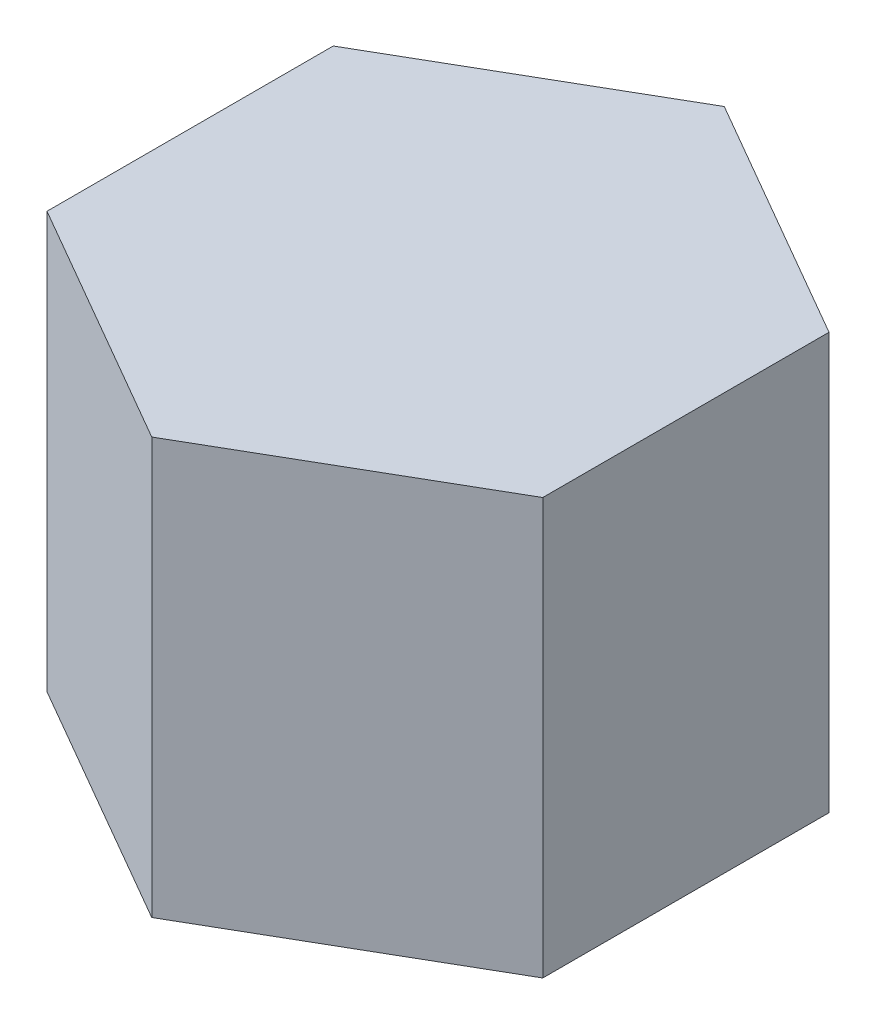
ISO-10303-21;
HEADER;
FILE_DESCRIPTION(('STEP AP214'),'2;1');
FILE_NAME('part.step','',(''),(''),'','','');
FILE_SCHEMA(('AUTOMOTIVE_DESIGN { 1 0 10303 214 1 1 1 1 }'));
ENDSEC;
DATA;
#1=APPLICATION_CONTEXT('core data for automotive mechanical design processes');
#2=APPLICATION_PROTOCOL_DEFINITION('international standard','automotive_design',2000,#1);
#3=PRODUCT_CONTEXT('',#1,'mechanical');
#4=PRODUCT('Part','Part','',(#3));
#5=PRODUCT_RELATED_PRODUCT_CATEGORY('part','',(#4));
#6=PRODUCT_DEFINITION_FORMATION('','',#4);
#7=PRODUCT_DEFINITION_CONTEXT('part definition',#1,'design');
#8=PRODUCT_DEFINITION('design','',#6,#7);
#9=PRODUCT_DEFINITION_SHAPE('','',#8);
#10=(LENGTH_UNIT() NAMED_UNIT(*) SI_UNIT(.MILLI.,.METRE.));
#11=(NAMED_UNIT(*) PLANE_ANGLE_UNIT() SI_UNIT($,.RADIAN.));
#12=(NAMED_UNIT(*) SI_UNIT($,.STERADIAN.) SOLID_ANGLE_UNIT());
#13=UNCERTAINTY_MEASURE_WITH_UNIT(LENGTH_MEASURE(1.E-05),#10,'distance_accuracy_value','');
#14=(GEOMETRIC_REPRESENTATION_CONTEXT(3) GLOBAL_UNCERTAINTY_ASSIGNED_CONTEXT((#13)) GLOBAL_UNIT_ASSIGNED_CONTEXT((#10,
#11,#12)) REPRESENTATION_CONTEXT('',''));
#15=CARTESIAN_POINT('',(0.,0.,0.));
#16=DIRECTION('',(0.,0.,1.));
#17=DIRECTION('',(1.,0.,0.));
#18=AXIS2_PLACEMENT_3D('',#15,#16,#17);
#19=CARTESIAN_POINT('',(207.339551417382,-147.556598747966,289.949920412926));
#20=DIRECTION('',(-0.499999999999943,0.,-0.866025403784471));
#21=DIRECTION('',(-0.866025403784471,0.,0.499999999999943));
#22=AXIS2_PLACEMENT_3D('',#19,#20,#21);
#23=PLANE('',#22);
#24=CARTESIAN_POINT('',(207.642660308706,-147.047793579175,289.774920412926));
#25=DIRECTION('',(-0.866025403784471,0.,0.499999999999943));
#26=VECTOR('',#25,1.);
#27=LINE('',#24,#26);
#28=CARTESIAN_POINT('',(207.642660308706,-147.047793579175,289.774920412926));
#29=VERTEX_POINT('',#28);
#30=CARTESIAN_POINT('',(207.339551417382,-147.047793579175,289.949920412926));
#31=VERTEX_POINT('',#30);
#32=EDGE_CURVE('E170',#29,#31,#27,.T.);
#33=ORIENTED_EDGE('',*,*,#32,.T.);
#34=CARTESIAN_POINT('',(207.339551417382,-147.556598747966,289.949920412926));
#35=DIRECTION('',(0.,1.,0.));
#36=VECTOR('',#35,1.);
#37=LINE('',#34,#36);
#38=CARTESIAN_POINT('',(207.339551417382,-147.556598747966,289.949920412926));
#39=VERTEX_POINT('',#38);
#40=EDGE_CURVE('E35',#39,#31,#37,.T.);
#41=ORIENTED_EDGE('',*,*,#40,.F.);
#42=CARTESIAN_POINT('',(207.642660308706,-147.556598747966,289.774920412926));
#43=DIRECTION('',(-0.866025403784471,0.,0.499999999999943));
#44=VECTOR('',#43,1.);
#45=LINE('',#42,#44);
#46=CARTESIAN_POINT('',(207.642660308706,-147.556598747966,289.774920412926));
#47=VERTEX_POINT('',#46);
#48=EDGE_CURVE('E159',#47,#39,#45,.T.);
#49=ORIENTED_EDGE('',*,*,#48,.F.);
#50=CARTESIAN_POINT('',(207.642660308706,-147.556598747966,289.774920412926));
#51=DIRECTION('',(0.,1.,0.));
#52=VECTOR('',#51,1.);
#53=LINE('',#50,#52);
#54=EDGE_CURVE('E10',#47,#29,#53,.T.);
#55=ORIENTED_EDGE('',*,*,#54,.T.);
#56=EDGE_LOOP('',(#33,#41,#49,#55));
#57=FACE_BOUND('',#56,.T.);
#58=ADVANCED_FACE('F16',(#57),#23,.F.);
#59=CARTESIAN_POINT('',(207.642660308706,-147.556598747966,291.594471220494));
#60=DIRECTION('',(-1.,0.,0.));
#61=DIRECTION('',(0.,-1.,0.));
#62=AXIS2_PLACEMENT_3D('',#59,#60,#61);
#63=PLANE('',#62);
#64=CARTESIAN_POINT('',(207.642660308706,-147.047793579175,289.424920412926));
#65=DIRECTION('',(0.,0.,1.));
#66=VECTOR('',#65,1.);
#67=LINE('',#64,#66);
#68=CARTESIAN_POINT('',(207.642660308706,-147.047793579175,289.424920412926));
#69=VERTEX_POINT('',#68);
#70=EDGE_CURVE('E167',#69,#29,#67,.T.);
#71=ORIENTED_EDGE('',*,*,#70,.T.);
#72=ORIENTED_EDGE('',*,*,#54,.F.);
#73=CARTESIAN_POINT('',(207.642660308706,-147.556598747966,289.424920412926));
#74=DIRECTION('',(0.,0.,1.));
#75=VECTOR('',#74,1.);
#76=LINE('',#73,#75);
#77=CARTESIAN_POINT('',(207.642660308706,-147.556598747966,289.424920412926));
#78=VERTEX_POINT('',#77);
#79=EDGE_CURVE('E156',#78,#47,#76,.T.);
#80=ORIENTED_EDGE('',*,*,#79,.F.);
#81=CARTESIAN_POINT('',(207.642660308706,-147.556598747966,289.424920412926));
#82=DIRECTION('',(0.,1.,0.));
#83=VECTOR('',#82,1.);
#84=LINE('',#81,#83);
#85=EDGE_CURVE('E27',#78,#69,#84,.T.);
#86=ORIENTED_EDGE('',*,*,#85,.T.);
#87=EDGE_LOOP('',(#71,#72,#80,#86));
#88=FACE_BOUND('',#87,.T.);
#89=ADVANCED_FACE('F189',(#88),#63,.F.);
#90=CARTESIAN_POINT('',(207.642660308706,-147.556598747966,289.424920412926));
#91=DIRECTION('',(-0.499999999999943,0.,0.866025403784471));
#92=DIRECTION('',(0.866025403784471,0.,0.499999999999943));
#93=AXIS2_PLACEMENT_3D('',#90,#91,#92);
#94=PLANE('',#93);
#95=CARTESIAN_POINT('',(207.339551417382,-147.047793579175,289.249920412926));
#96=DIRECTION('',(0.866025403784471,0.,0.499999999999943));
#97=VECTOR('',#96,1.);
#98=LINE('',#95,#97);
#99=CARTESIAN_POINT('',(207.339551417382,-147.047793579175,289.249920412926));
#100=VERTEX_POINT('',#99);
#101=EDGE_CURVE('E163',#100,#69,#98,.T.);
#102=ORIENTED_EDGE('',*,*,#101,.T.);
#103=ORIENTED_EDGE('',*,*,#85,.F.);
#104=CARTESIAN_POINT('',(207.339551417382,-147.556598747966,289.249920412926));
#105=DIRECTION('',(0.866025403784471,0.,0.499999999999943));
#106=VECTOR('',#105,1.);
#107=LINE('',#104,#106);
#108=CARTESIAN_POINT('',(207.339551417382,-147.556598747966,289.249920412926));
#109=VERTEX_POINT('',#108);
#110=EDGE_CURVE('E106',#109,#78,#107,.T.);
#111=ORIENTED_EDGE('',*,*,#110,.F.);
#112=CARTESIAN_POINT('',(207.339551417382,-147.556598747966,289.249920412926));
#113=DIRECTION('',(0.,1.,0.));
#114=VECTOR('',#113,1.);
#115=LINE('',#112,#114);
#116=EDGE_CURVE('E94',#109,#100,#115,.T.);
#117=ORIENTED_EDGE('',*,*,#116,.T.);
#118=EDGE_LOOP('',(#102,#103,#111,#117));
#119=FACE_BOUND('',#118,.T.);
#120=ADVANCED_FACE('F198',(#119),#94,.F.);
#121=CARTESIAN_POINT('',(207.339551417382,-147.556598747966,289.249920412926));
#122=DIRECTION('',(0.499999999999978,0.,0.866025403784452));
#123=DIRECTION('',(0.866025403784452,0.,-0.499999999999978));
#124=AXIS2_PLACEMENT_3D('',#121,#122,#123);
#125=PLANE('',#124);
#126=CARTESIAN_POINT('',(207.036442526057,-147.047793579175,289.424920412926));
#127=DIRECTION('',(0.866025403784452,0.,-0.499999999999978));
#128=VECTOR('',#127,1.);
#129=LINE('',#126,#128);
#130=CARTESIAN_POINT('',(207.036442526057,-147.047793579175,289.424920412926));
#131=VERTEX_POINT('',#130);
#132=EDGE_CURVE('E162',#131,#100,#129,.T.);
#133=ORIENTED_EDGE('',*,*,#132,.T.);
#134=ORIENTED_EDGE('',*,*,#116,.F.);
#135=CARTESIAN_POINT('',(207.036442526057,-147.556598747966,289.424920412926));
#136=DIRECTION('',(0.866025403784452,0.,-0.499999999999978));
#137=VECTOR('',#136,1.);
#138=LINE('',#135,#137);
#139=CARTESIAN_POINT('',(207.036442526057,-147.556598747966,289.424920412926));
#140=VERTEX_POINT('',#139);
#141=EDGE_CURVE('E98',#140,#109,#138,.T.);
#142=ORIENTED_EDGE('',*,*,#141,.F.);
#143=CARTESIAN_POINT('',(207.036442526057,-147.556598747966,289.424920412926));
#144=DIRECTION('',(0.,1.,0.));
#145=VECTOR('',#144,1.);
#146=LINE('',#143,#145);
#147=EDGE_CURVE('E79',#140,#131,#146,.T.);
#148=ORIENTED_EDGE('',*,*,#147,.T.);
#149=EDGE_LOOP('',(#133,#134,#142,#148));
#150=FACE_BOUND('',#149,.T.);
#151=ADVANCED_FACE('F100',(#150),#125,.F.);
#152=CARTESIAN_POINT('',(207.036442526057,-147.556598747966,291.594471220494));
#153=DIRECTION('',(1.,0.,0.));
#154=DIRECTION('',(0.,1.,0.));
#155=AXIS2_PLACEMENT_3D('',#152,#153,#154);
#156=PLANE('',#155);
#157=CARTESIAN_POINT('',(207.036442526057,-147.047793579175,289.774920412926));
#158=DIRECTION('',(0.,0.,-1.));
#159=VECTOR('',#158,1.);
#160=LINE('',#157,#159);
#161=CARTESIAN_POINT('',(207.036442526057,-147.047793579175,289.774920412926));
#162=VERTEX_POINT('',#161);
#163=EDGE_CURVE('E88',#162,#131,#160,.T.);
#164=ORIENTED_EDGE('',*,*,#163,.T.);
#165=ORIENTED_EDGE('',*,*,#147,.F.);
#166=CARTESIAN_POINT('',(207.036442526057,-147.556598747966,289.774920412926));
#167=DIRECTION('',(0.,0.,-1.));
#168=VECTOR('',#167,1.);
#169=LINE('',#166,#168);
#170=CARTESIAN_POINT('',(207.036442526057,-147.556598747966,289.774920412926));
#171=VERTEX_POINT('',#170);
#172=EDGE_CURVE('E84',#171,#140,#169,.T.);
#173=ORIENTED_EDGE('',*,*,#172,.F.);
#174=CARTESIAN_POINT('',(207.036442526057,-147.556598747966,289.774920412926));
#175=DIRECTION('',(0.,1.,0.));
#176=VECTOR('',#175,1.);
#177=LINE('',#174,#176);
#178=EDGE_CURVE('E58',#171,#162,#177,.T.);
#179=ORIENTED_EDGE('',*,*,#178,.T.);
#180=EDGE_LOOP('',(#164,#165,#173,#179));
#181=FACE_BOUND('',#180,.T.);
#182=ADVANCED_FACE('F82',(#181),#156,.F.);
#183=CARTESIAN_POINT('',(207.036442526057,-147.556598747966,289.774920412926));
#184=DIRECTION('',(0.499999999999978,0.,-0.866025403784452));
#185=DIRECTION('',(-0.866025403784452,0.,-0.499999999999978));
#186=AXIS2_PLACEMENT_3D('',#183,#184,#185);
#187=PLANE('',#186);
#188=CARTESIAN_POINT('',(207.339551417382,-147.047793579175,289.949920412926));
#189=DIRECTION('',(-0.866025403784452,0.,-0.499999999999978));
#190=VECTOR('',#189,1.);
#191=LINE('',#188,#190);
#192=EDGE_CURVE('E160',#31,#162,#191,.T.);
#193=ORIENTED_EDGE('',*,*,#192,.T.);
#194=ORIENTED_EDGE('',*,*,#178,.F.);
#195=CARTESIAN_POINT('',(207.339551417382,-147.556598747966,289.949920412926));
#196=DIRECTION('',(-0.866025403784452,0.,-0.499999999999978));
#197=VECTOR('',#196,1.);
#198=LINE('',#195,#197);
#199=EDGE_CURVE('E112',#39,#171,#198,.T.);
#200=ORIENTED_EDGE('',*,*,#199,.F.);
#201=ORIENTED_EDGE('',*,*,#40,.T.);
#202=EDGE_LOOP('',(#193,#194,#200,#201));
#203=FACE_BOUND('',#202,.T.);
#204=ADVANCED_FACE('F131',(#203),#187,.F.);
#205=CARTESIAN_POINT('',(206.491105863044,-147.556598747966,291.594471220494));
#206=DIRECTION('',(0.,1.,0.));
#207=DIRECTION('',(-1.,0.,0.));
#208=AXIS2_PLACEMENT_3D('',#205,#206,#207);
#209=PLANE('',#208);
#210=ORIENTED_EDGE('',*,*,#48,.T.);
#211=ORIENTED_EDGE('',*,*,#199,.T.);
#212=ORIENTED_EDGE('',*,*,#172,.T.);
#213=ORIENTED_EDGE('',*,*,#141,.T.);
#214=ORIENTED_EDGE('',*,*,#110,.T.);
#215=ORIENTED_EDGE('',*,*,#79,.T.);
#216=EDGE_LOOP('',(#210,#211,#212,#213,#214,#215));
#217=FACE_BOUND('',#216,.T.);
#218=ADVANCED_FACE('F111',(#217),#209,.F.);
#219=CARTESIAN_POINT('',(206.491105863044,-147.047793579175,291.594471220494));
#220=DIRECTION('',(0.,1.,0.));
#221=DIRECTION('',(-1.,0.,0.));
#222=AXIS2_PLACEMENT_3D('',#219,#220,#221);
#223=PLANE('',#222);
#224=ORIENTED_EDGE('',*,*,#32,.F.);
#225=ORIENTED_EDGE('',*,*,#70,.F.);
#226=ORIENTED_EDGE('',*,*,#101,.F.);
#227=ORIENTED_EDGE('',*,*,#132,.F.);
#228=ORIENTED_EDGE('',*,*,#163,.F.);
#229=ORIENTED_EDGE('',*,*,#192,.F.);
#230=EDGE_LOOP('',(#224,#225,#226,#227,#228,#229));
#231=FACE_BOUND('',#230,.T.);
#232=ADVANCED_FACE('F130',(#231),#223,.T.);
#233=CLOSED_SHELL('',(#58,#89,#120,#151,#182,#204,#218,#232));
#234=MANIFOLD_SOLID_BREP('B1',#233);
#235=ADVANCED_BREP_SHAPE_REPRESENTATION('',(#18,#234),#14);
#236=SHAPE_DEFINITION_REPRESENTATION(#9,#235);
ENDSEC;
END-ISO-10303-21;
